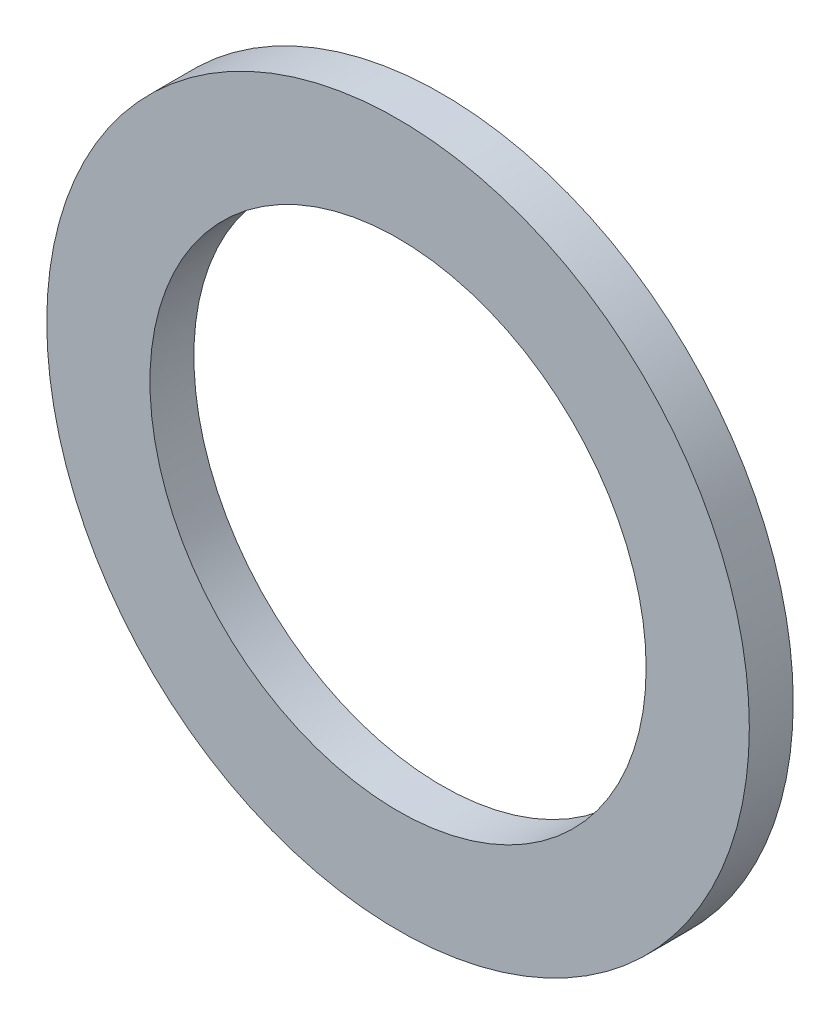
ISO-10303-21;
HEADER;
FILE_DESCRIPTION(('STEP AP214'),'2;1');
FILE_NAME('part.step','',(''),(''),'','','');
FILE_SCHEMA(('AUTOMOTIVE_DESIGN { 1 0 10303 214 1 1 1 1 }'));
ENDSEC;
DATA;
#1=APPLICATION_CONTEXT('core data for automotive mechanical design processes');
#2=APPLICATION_PROTOCOL_DEFINITION('international standard','automotive_design',2000,#1);
#3=PRODUCT_CONTEXT('',#1,'mechanical');
#4=PRODUCT('Part','Part','',(#3));
#5=PRODUCT_RELATED_PRODUCT_CATEGORY('part','',(#4));
#6=PRODUCT_DEFINITION_FORMATION('','',#4);
#7=PRODUCT_DEFINITION_CONTEXT('part definition',#1,'design');
#8=PRODUCT_DEFINITION('design','',#6,#7);
#9=PRODUCT_DEFINITION_SHAPE('','',#8);
#10=(LENGTH_UNIT() NAMED_UNIT(*) SI_UNIT(.MILLI.,.METRE.));
#11=(NAMED_UNIT(*) PLANE_ANGLE_UNIT() SI_UNIT($,.RADIAN.));
#12=(NAMED_UNIT(*) SI_UNIT($,.STERADIAN.) SOLID_ANGLE_UNIT());
#13=UNCERTAINTY_MEASURE_WITH_UNIT(LENGTH_MEASURE(1.E-05),#10,'distance_accuracy_value','');
#14=(GEOMETRIC_REPRESENTATION_CONTEXT(3) GLOBAL_UNCERTAINTY_ASSIGNED_CONTEXT((#13)) GLOBAL_UNIT_ASSIGNED_CONTEXT((#10,
#11,#12)) REPRESENTATION_CONTEXT('',''));
#15=CARTESIAN_POINT('',(0.,0.,0.));
#16=DIRECTION('',(0.,0.,1.));
#17=DIRECTION('',(1.,0.,0.));
#18=AXIS2_PLACEMENT_3D('',#15,#16,#17);
#19=CARTESIAN_POINT('',(0.,0.,-1.));
#20=DIRECTION('',(0.,0.,1.));
#21=DIRECTION('',(1.,0.,0.));
#22=AXIS2_PLACEMENT_3D('',#19,#20,#21);
#23=CYLINDRICAL_SURFACE('',#22,8.);
#24=CARTESIAN_POINT('',(0.,0.,-1.));
#25=DIRECTION('',(0.,0.,1.));
#26=DIRECTION('',(1.,0.,0.));
#27=AXIS2_PLACEMENT_3D('',#24,#25,#26);
#28=CIRCLE('',#27,8.);
#29=CARTESIAN_POINT('',(8.,0.,-1.));
#30=VERTEX_POINT('',#29);
#31=EDGE_CURVE('E10',#30,#30,#28,.T.);
#32=ORIENTED_EDGE('',*,*,#31,.T.);
#33=EDGE_LOOP('',(#32));
#34=FACE_BOUND('',#33,.T.);
#35=CARTESIAN_POINT('',(0.,0.,0.));
#36=DIRECTION('',(0.,0.,1.));
#37=DIRECTION('',(1.,0.,0.));
#38=AXIS2_PLACEMENT_3D('',#35,#36,#37);
#39=CIRCLE('',#38,8.);
#40=CARTESIAN_POINT('',(8.,0.,0.));
#41=VERTEX_POINT('',#40);
#42=EDGE_CURVE('E34',#41,#41,#39,.T.);
#43=ORIENTED_EDGE('',*,*,#42,.F.);
#44=EDGE_LOOP('',(#43));
#45=FACE_BOUND('',#44,.T.);
#46=ADVANCED_FACE('F31',(#34,#45),#23,.T.);
#47=CARTESIAN_POINT('',(0.,0.,-1.));
#48=DIRECTION('',(0.,0.,1.));
#49=DIRECTION('',(1.,0.,0.));
#50=AXIS2_PLACEMENT_3D('',#47,#48,#49);
#51=PLANE('',#50);
#52=CARTESIAN_POINT('',(0.,0.,-1.));
#53=DIRECTION('',(0.,0.,1.));
#54=DIRECTION('',(1.,0.,0.));
#55=AXIS2_PLACEMENT_3D('',#52,#53,#54);
#56=CIRCLE('',#55,5.65);
#57=CARTESIAN_POINT('',(5.65,0.,-1.));
#58=VERTEX_POINT('',#57);
#59=EDGE_CURVE('E41',#58,#58,#56,.T.);
#60=ORIENTED_EDGE('',*,*,#59,.T.);
#61=EDGE_LOOP('',(#60));
#62=FACE_BOUND('',#61,.T.);
#63=ORIENTED_EDGE('',*,*,#31,.F.);
#64=EDGE_LOOP('',(#63));
#65=FACE_BOUND('',#64,.T.);
#66=ADVANCED_FACE('F49',(#62,#65),#51,.F.);
#67=CARTESIAN_POINT('',(0.,0.,0.));
#68=DIRECTION('',(0.,0.,1.));
#69=DIRECTION('',(1.,0.,0.));
#70=AXIS2_PLACEMENT_3D('',#67,#68,#69);
#71=PLANE('',#70);
#72=CARTESIAN_POINT('',(0.,0.,0.));
#73=DIRECTION('',(0.,0.,1.));
#74=DIRECTION('',(1.,0.,0.));
#75=AXIS2_PLACEMENT_3D('',#72,#73,#74);
#76=CIRCLE('',#75,5.65);
#77=CARTESIAN_POINT('',(5.65,0.,0.));
#78=VERTEX_POINT('',#77);
#79=EDGE_CURVE('E43',#78,#78,#76,.T.);
#80=ORIENTED_EDGE('',*,*,#79,.F.);
#81=EDGE_LOOP('',(#80));
#82=FACE_BOUND('',#81,.T.);
#83=ORIENTED_EDGE('',*,*,#42,.T.);
#84=EDGE_LOOP('',(#83));
#85=FACE_BOUND('',#84,.T.);
#86=ADVANCED_FACE('F55',(#82,#85),#71,.T.);
#87=CARTESIAN_POINT('',(0.,0.,-1.));
#88=DIRECTION('',(0.,0.,1.));
#89=DIRECTION('',(1.,0.,0.));
#90=AXIS2_PLACEMENT_3D('',#87,#88,#89);
#91=CYLINDRICAL_SURFACE('',#90,5.65);
#92=ORIENTED_EDGE('',*,*,#59,.F.);
#93=EDGE_LOOP('',(#92));
#94=FACE_BOUND('',#93,.T.);
#95=ORIENTED_EDGE('',*,*,#79,.T.);
#96=EDGE_LOOP('',(#95));
#97=FACE_BOUND('',#96,.T.);
#98=ADVANCED_FACE('F52',(#94,#97),#91,.F.);
#99=CLOSED_SHELL('',(#46,#66,#86,#98));
#100=MANIFOLD_SOLID_BREP('B2',#99);
#101=ADVANCED_BREP_SHAPE_REPRESENTATION('',(#18,#100),#14);
#102=SHAPE_DEFINITION_REPRESENTATION(#9,#101);
ENDSEC;
END-ISO-10303-21;
